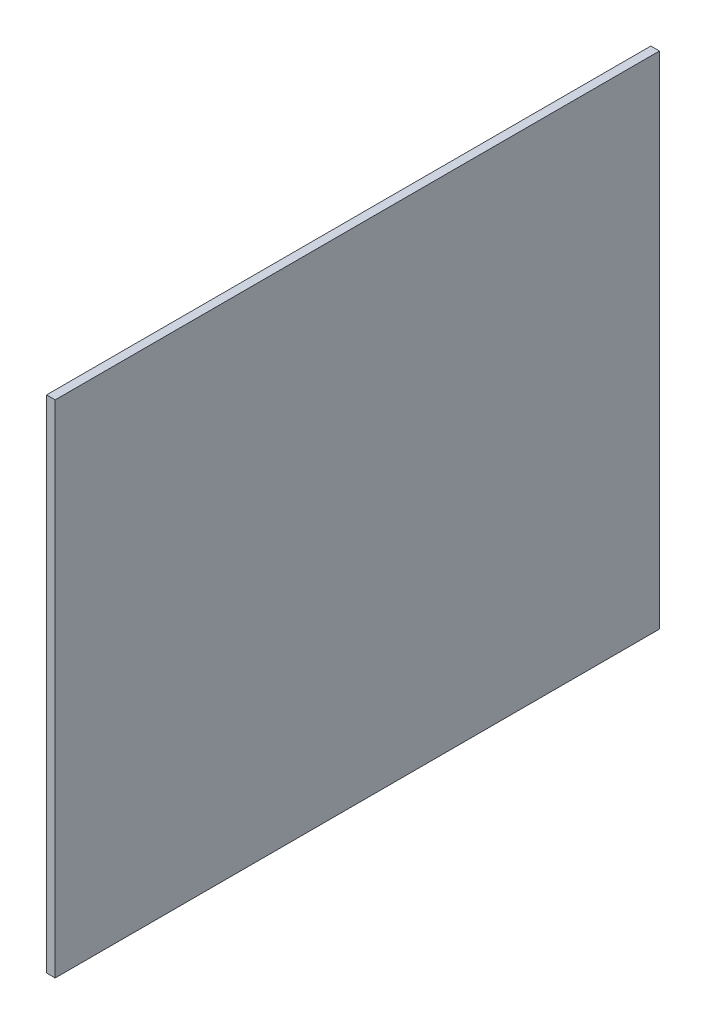
ISO-10303-21;
HEADER;
FILE_DESCRIPTION(('STEP AP214'),'2;1');
FILE_NAME('part.step','',(''),(''),'','','');
FILE_SCHEMA(('AUTOMOTIVE_DESIGN { 1 0 10303 214 1 1 1 1 }'));
ENDSEC;
DATA;
#1=APPLICATION_CONTEXT('core data for automotive mechanical design processes');
#2=APPLICATION_PROTOCOL_DEFINITION('international standard','automotive_design',2000,#1);
#3=PRODUCT_CONTEXT('',#1,'mechanical');
#4=PRODUCT('Part','Part','',(#3));
#5=PRODUCT_RELATED_PRODUCT_CATEGORY('part','',(#4));
#6=PRODUCT_DEFINITION_FORMATION('','',#4);
#7=PRODUCT_DEFINITION_CONTEXT('part definition',#1,'design');
#8=PRODUCT_DEFINITION('design','',#6,#7);
#9=PRODUCT_DEFINITION_SHAPE('','',#8);
#10=(LENGTH_UNIT() NAMED_UNIT(*) SI_UNIT(.MILLI.,.METRE.));
#11=(NAMED_UNIT(*) PLANE_ANGLE_UNIT() SI_UNIT($,.RADIAN.));
#12=(NAMED_UNIT(*) SI_UNIT($,.STERADIAN.) SOLID_ANGLE_UNIT());
#13=UNCERTAINTY_MEASURE_WITH_UNIT(LENGTH_MEASURE(1.E-05),#10,'distance_accuracy_value','');
#14=(GEOMETRIC_REPRESENTATION_CONTEXT(3) GLOBAL_UNCERTAINTY_ASSIGNED_CONTEXT((#13)) GLOBAL_UNIT_ASSIGNED_CONTEXT((#10,
#11,#12)) REPRESENTATION_CONTEXT('',''));
#15=CARTESIAN_POINT('',(0.,0.,0.));
#16=DIRECTION('',(0.,0.,1.));
#17=DIRECTION('',(1.,0.,0.));
#18=AXIS2_PLACEMENT_3D('',#15,#16,#17);
#19=CARTESIAN_POINT('',(10.,0.,0.));
#20=DIRECTION('',(0.,0.,-1.));
#21=DIRECTION('',(-1.,0.,0.));
#22=AXIS2_PLACEMENT_3D('',#19,#20,#21);
#23=PLANE('',#22);
#24=DIRECTION('',(0.,-1.,0.));
#25=VECTOR('',#24,1.);
#26=CARTESIAN_POINT('',(0.,0.,0.));
#27=LINE('',#26,#25);
#28=CARTESIAN_POINT('',(0.,580.,0.));
#29=VERTEX_POINT('',#28);
#30=CARTESIAN_POINT('',(0.,0.,0.));
#31=VERTEX_POINT('',#30);
#32=EDGE_CURVE('E111',#29,#31,#27,.T.);
#33=ORIENTED_EDGE('',*,*,#32,.T.);
#34=DIRECTION('',(-1.,0.,0.));
#35=VECTOR('',#34,1.);
#36=CARTESIAN_POINT('',(10.,0.,0.));
#37=LINE('',#36,#35);
#38=CARTESIAN_POINT('',(10.,0.,0.));
#39=VERTEX_POINT('',#38);
#40=EDGE_CURVE('E11',#39,#31,#37,.T.);
#41=ORIENTED_EDGE('',*,*,#40,.F.);
#42=DIRECTION('',(0.,-1.,0.));
#43=VECTOR('',#42,1.);
#44=CARTESIAN_POINT('',(10.,0.,0.));
#45=LINE('',#44,#43);
#46=CARTESIAN_POINT('',(10.,580.,0.));
#47=VERTEX_POINT('',#46);
#48=EDGE_CURVE('E95',#47,#39,#45,.T.);
#49=ORIENTED_EDGE('',*,*,#48,.F.);
#50=DIRECTION('',(-1.,0.,0.));
#51=VECTOR('',#50,1.);
#52=CARTESIAN_POINT('',(10.,580.,0.));
#53=LINE('',#52,#51);
#54=EDGE_CURVE('E107',#47,#29,#53,.T.);
#55=ORIENTED_EDGE('',*,*,#54,.T.);
#56=EDGE_LOOP('',(#33,#41,#49,#55));
#57=FACE_BOUND('',#56,.T.);
#58=ADVANCED_FACE('F43',(#57),#23,.F.);
#59=CARTESIAN_POINT('',(10.,0.,0.));
#60=DIRECTION('',(0.,1.,0.));
#61=DIRECTION('',(0.,0.,1.));
#62=AXIS2_PLACEMENT_3D('',#59,#60,#61);
#63=PLANE('',#62);
#64=DIRECTION('',(0.,0.,-1.));
#65=VECTOR('',#64,1.);
#66=CARTESIAN_POINT('',(0.,0.,0.));
#67=LINE('',#66,#65);
#68=CARTESIAN_POINT('',(0.,0.,-700.));
#69=VERTEX_POINT('',#68);
#70=EDGE_CURVE('E100',#31,#69,#67,.T.);
#71=ORIENTED_EDGE('',*,*,#70,.T.);
#72=DIRECTION('',(-1.,0.,0.));
#73=VECTOR('',#72,1.);
#74=CARTESIAN_POINT('',(10.,0.,-700.));
#75=LINE('',#74,#73);
#76=CARTESIAN_POINT('',(10.,0.,-700.));
#77=VERTEX_POINT('',#76);
#78=EDGE_CURVE('E52',#77,#69,#75,.T.);
#79=ORIENTED_EDGE('',*,*,#78,.F.);
#80=DIRECTION('',(0.,0.,-1.));
#81=VECTOR('',#80,1.);
#82=CARTESIAN_POINT('',(10.,0.,0.));
#83=LINE('',#82,#81);
#84=EDGE_CURVE('E90',#39,#77,#83,.T.);
#85=ORIENTED_EDGE('',*,*,#84,.F.);
#86=ORIENTED_EDGE('',*,*,#40,.T.);
#87=EDGE_LOOP('',(#71,#79,#85,#86));
#88=FACE_BOUND('',#87,.T.);
#89=ADVANCED_FACE('F99',(#88),#63,.F.);
#90=CARTESIAN_POINT('',(10.,0.,-700.));
#91=DIRECTION('',(0.,0.,1.));
#92=DIRECTION('',(1.,0.,0.));
#93=AXIS2_PLACEMENT_3D('',#90,#91,#92);
#94=PLANE('',#93);
#95=DIRECTION('',(0.,1.,0.));
#96=VECTOR('',#95,1.);
#97=CARTESIAN_POINT('',(0.,0.,-700.));
#98=LINE('',#97,#96);
#99=CARTESIAN_POINT('',(0.,580.,-700.));
#100=VERTEX_POINT('',#99);
#101=EDGE_CURVE('E77',#69,#100,#98,.T.);
#102=ORIENTED_EDGE('',*,*,#101,.T.);
#103=DIRECTION('',(-1.,0.,0.));
#104=VECTOR('',#103,1.);
#105=CARTESIAN_POINT('',(10.,580.,-700.));
#106=LINE('',#105,#104);
#107=CARTESIAN_POINT('',(10.,580.,-700.));
#108=VERTEX_POINT('',#107);
#109=EDGE_CURVE('E102',#108,#100,#106,.T.);
#110=ORIENTED_EDGE('',*,*,#109,.F.);
#111=DIRECTION('',(0.,1.,0.));
#112=VECTOR('',#111,1.);
#113=CARTESIAN_POINT('',(10.,0.,-700.));
#114=LINE('',#113,#112);
#115=EDGE_CURVE('E93',#77,#108,#114,.T.);
#116=ORIENTED_EDGE('',*,*,#115,.F.);
#117=ORIENTED_EDGE('',*,*,#78,.T.);
#118=EDGE_LOOP('',(#102,#110,#116,#117));
#119=FACE_BOUND('',#118,.T.);
#120=ADVANCED_FACE('F103',(#119),#94,.F.);
#121=CARTESIAN_POINT('',(10.,580.,0.));
#122=DIRECTION('',(0.,-1.,0.));
#123=DIRECTION('',(0.,0.,-1.));
#124=AXIS2_PLACEMENT_3D('',#121,#122,#123);
#125=PLANE('',#124);
#126=DIRECTION('',(0.,0.,1.));
#127=VECTOR('',#126,1.);
#128=CARTESIAN_POINT('',(0.,580.,0.));
#129=LINE('',#128,#127);
#130=EDGE_CURVE('E83',#100,#29,#129,.T.);
#131=ORIENTED_EDGE('',*,*,#130,.T.);
#132=ORIENTED_EDGE('',*,*,#54,.F.);
#133=DIRECTION('',(0.,0.,1.));
#134=VECTOR('',#133,1.);
#135=CARTESIAN_POINT('',(10.,580.,0.));
#136=LINE('',#135,#134);
#137=EDGE_CURVE('E60',#108,#47,#136,.T.);
#138=ORIENTED_EDGE('',*,*,#137,.F.);
#139=ORIENTED_EDGE('',*,*,#109,.T.);
#140=EDGE_LOOP('',(#131,#132,#138,#139));
#141=FACE_BOUND('',#140,.T.);
#142=ADVANCED_FACE('F124',(#141),#125,.F.);
#143=CARTESIAN_POINT('',(10.,0.,0.));
#144=DIRECTION('',(-1.,0.,0.));
#145=DIRECTION('',(0.,0.,1.));
#146=AXIS2_PLACEMENT_3D('',#143,#144,#145);
#147=PLANE('',#146);
#148=ORIENTED_EDGE('',*,*,#48,.T.);
#149=ORIENTED_EDGE('',*,*,#84,.T.);
#150=ORIENTED_EDGE('',*,*,#115,.T.);
#151=ORIENTED_EDGE('',*,*,#137,.T.);
#152=EDGE_LOOP('',(#148,#149,#150,#151));
#153=FACE_BOUND('',#152,.T.);
#154=ADVANCED_FACE('F91',(#153),#147,.F.);
#155=CARTESIAN_POINT('',(0.,0.,0.));
#156=DIRECTION('',(-1.,0.,0.));
#157=DIRECTION('',(0.,0.,1.));
#158=AXIS2_PLACEMENT_3D('',#155,#156,#157);
#159=PLANE('',#158);
#160=ORIENTED_EDGE('',*,*,#32,.F.);
#161=ORIENTED_EDGE('',*,*,#130,.F.);
#162=ORIENTED_EDGE('',*,*,#101,.F.);
#163=ORIENTED_EDGE('',*,*,#70,.F.);
#164=EDGE_LOOP('',(#160,#161,#162,#163));
#165=FACE_BOUND('',#164,.T.);
#166=ADVANCED_FACE('F127',(#165),#159,.T.);
#167=CLOSED_SHELL('',(#58,#89,#120,#142,#154,#166));
#168=MANIFOLD_SOLID_BREP('B2',#167);
#169=ADVANCED_BREP_SHAPE_REPRESENTATION('',(#18,#168),#14);
#170=SHAPE_DEFINITION_REPRESENTATION(#9,#169);
ENDSEC;
END-ISO-10303-21;
